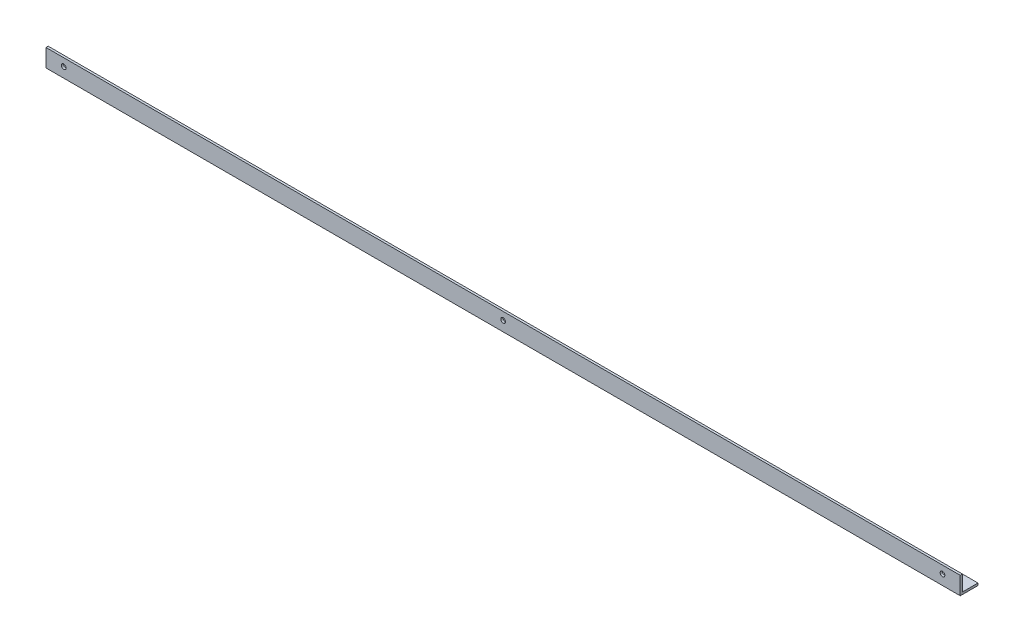
ISO-10303-21;
HEADER;
FILE_DESCRIPTION(('STEP AP214'),'2;1');
FILE_NAME('part.step','',(''),(''),'','','');
FILE_SCHEMA(('AUTOMOTIVE_DESIGN { 1 0 10303 214 1 1 1 1 }'));
ENDSEC;
DATA;
#1=APPLICATION_CONTEXT('core data for automotive mechanical design processes');
#2=APPLICATION_PROTOCOL_DEFINITION('international standard','automotive_design',2000,#1);
#3=PRODUCT_CONTEXT('',#1,'mechanical');
#4=PRODUCT('Part','Part','',(#3));
#5=PRODUCT_RELATED_PRODUCT_CATEGORY('part','',(#4));
#6=PRODUCT_DEFINITION_FORMATION('','',#4);
#7=PRODUCT_DEFINITION_CONTEXT('part definition',#1,'design');
#8=PRODUCT_DEFINITION('design','',#6,#7);
#9=PRODUCT_DEFINITION_SHAPE('','',#8);
#10=(LENGTH_UNIT() NAMED_UNIT(*) SI_UNIT(.MILLI.,.METRE.));
#11=(NAMED_UNIT(*) PLANE_ANGLE_UNIT() SI_UNIT($,.RADIAN.));
#12=(NAMED_UNIT(*) SI_UNIT($,.STERADIAN.) SOLID_ANGLE_UNIT());
#13=UNCERTAINTY_MEASURE_WITH_UNIT(LENGTH_MEASURE(1.E-05),#10,'distance_accuracy_value','');
#14=(GEOMETRIC_REPRESENTATION_CONTEXT(3) GLOBAL_UNCERTAINTY_ASSIGNED_CONTEXT((#13)) GLOBAL_UNIT_ASSIGNED_CONTEXT((#10,
#11,#12)) REPRESENTATION_CONTEXT('',''));
#15=CARTESIAN_POINT('',(0.,0.,0.));
#16=DIRECTION('',(0.,0.,1.));
#17=DIRECTION('',(1.,0.,0.));
#18=AXIS2_PLACEMENT_3D('',#15,#16,#17);
#19=CARTESIAN_POINT('',(-1307.86854000227,166.234228507342,2858.97175722218));
#20=DIRECTION('',(-1.,0.,0.));
#21=DIRECTION('',(0.,0.26471698178117,-0.964326147917118));
#22=AXIS2_PLACEMENT_3D('',#19,#20,#21);
#23=PLANE('',#22);
#24=DIRECTION('',(0.,-1.,0.));
#25=VECTOR('',#24,1.);
#26=CARTESIAN_POINT('',(-1307.86854000227,1.58750000000062,2820.87175722218));
#27=LINE('',#26,#25);
#28=CARTESIAN_POINT('',(-1307.86854000227,3.17500000000019,2820.87175722218));
#29=VERTEX_POINT('',#28);
#30=CARTESIAN_POINT('',(-1307.86854000227,0.,2820.87175722218));
#31=VERTEX_POINT('',#30);
#32=EDGE_CURVE('E200',#29,#31,#27,.T.);
#33=ORIENTED_EDGE('',*,*,#32,.T.);
#34=DIRECTION('',(0.,0.,1.));
#35=VECTOR('',#34,1.);
#36=CARTESIAN_POINT('',(-1307.86854000227,1.54219239510193E-13,2833.57175722218));
#37=LINE('',#36,#35);
#38=CARTESIAN_POINT('',(-1307.86854000227,-1.2884804952989E-12,2846.27175722218));
#39=VERTEX_POINT('',#38);
#40=EDGE_CURVE('E183',#31,#39,#37,.T.);
#41=ORIENTED_EDGE('',*,*,#40,.T.);
#42=DIRECTION('',(0.,1.,0.));
#43=VECTOR('',#42,1.);
#44=CARTESIAN_POINT('',(-1307.86854000227,12.6999999999988,2846.27175722218));
#45=LINE('',#44,#43);
#46=CARTESIAN_POINT('',(-1307.86854000227,25.4,2846.27175722218));
#47=VERTEX_POINT('',#46);
#48=EDGE_CURVE('E128',#39,#47,#45,.T.);
#49=ORIENTED_EDGE('',*,*,#48,.T.);
#50=DIRECTION('',(0.,0.,-1.));
#51=VECTOR('',#50,1.);
#52=CARTESIAN_POINT('',(-1307.86854000227,25.4000000000001,2844.68425722218));
#53=LINE('',#52,#51);
#54=CARTESIAN_POINT('',(-1307.86854000227,25.4000000000003,2843.09675722218));
#55=VERTEX_POINT('',#54);
#56=EDGE_CURVE('E113',#47,#55,#53,.T.);
#57=ORIENTED_EDGE('',*,*,#56,.T.);
#58=DIRECTION('',(0.,-1.,0.));
#59=VECTOR('',#58,1.);
#60=CARTESIAN_POINT('',(-1307.86854000227,14.2875000000003,2843.09675722218));
#61=LINE('',#60,#59);
#62=CARTESIAN_POINT('',(-1307.86854000227,3.17500000000025,2843.09675722218));
#63=VERTEX_POINT('',#62);
#64=EDGE_CURVE('E125',#55,#63,#61,.T.);
#65=ORIENTED_EDGE('',*,*,#64,.T.);
#66=DIRECTION('',(0.,0.,-1.));
#67=VECTOR('',#66,1.);
#68=CARTESIAN_POINT('',(-1307.86854000227,3.17500000000041,2831.98425722218));
#69=LINE('',#68,#67);
#70=EDGE_CURVE('E130',#63,#29,#69,.T.);
#71=ORIENTED_EDGE('',*,*,#70,.T.);
#72=EDGE_LOOP('',(#33,#41,#49,#57,#65,#71));
#73=FACE_BOUND('',#72,.T.);
#74=ADVANCED_FACE('F42',(#73),#23,.T.);
#75=CARTESIAN_POINT('',(-5072.16606568212,1.58750000000062,2820.87175722218));
#76=DIRECTION('',(0.,0.,1.));
#77=DIRECTION('',(0.,1.,0.));
#78=AXIS2_PLACEMENT_3D('',#75,#76,#77);
#79=PLANE('',#78);
#80=DIRECTION('',(1.,0.,0.));
#81=VECTOR('',#80,1.);
#82=CARTESIAN_POINT('',(-5072.16606568212,0.,2820.87175722218));
#83=LINE('',#82,#81);
#84=CARTESIAN_POINT('',(0.,0.,2820.87175722218));
#85=VERTEX_POINT('',#84);
#86=EDGE_CURVE('E146',#31,#85,#83,.T.);
#87=ORIENTED_EDGE('',*,*,#86,.F.);
#88=ORIENTED_EDGE('',*,*,#32,.F.);
#89=DIRECTION('',(1.,0.,0.));
#90=VECTOR('',#89,1.);
#91=CARTESIAN_POINT('',(-5072.16606568212,3.17500000000019,2820.87175722218));
#92=LINE('',#91,#90);
#93=CARTESIAN_POINT('',(0.,3.17500000000019,2820.87175722218));
#94=VERTEX_POINT('',#93);
#95=EDGE_CURVE('E143',#29,#94,#92,.T.);
#96=ORIENTED_EDGE('',*,*,#95,.T.);
#97=DIRECTION('',(0.,-1.,0.));
#98=VECTOR('',#97,1.);
#99=CARTESIAN_POINT('',(0.,1.58750000000062,2820.87175722218));
#100=LINE('',#99,#98);
#101=EDGE_CURVE('E182',#94,#85,#100,.T.);
#102=ORIENTED_EDGE('',*,*,#101,.T.);
#103=EDGE_LOOP('',(#87,#88,#96,#102));
#104=FACE_BOUND('',#103,.T.);
#105=ADVANCED_FACE('F211',(#104),#79,.F.);
#106=CARTESIAN_POINT('',(-5072.16606568212,1.54219239510193E-13,2833.57175722218));
#107=DIRECTION('',(0.,1.,0.));
#108=DIRECTION('',(0.,0.,-1.));
#109=AXIS2_PLACEMENT_3D('',#106,#107,#108);
#110=PLANE('',#109);
#111=DIRECTION('',(1.,0.,0.));
#112=VECTOR('',#111,1.);
#113=CARTESIAN_POINT('',(-5072.16606568212,-1.2884804952989E-12,2846.27175722218));
#114=LINE('',#113,#112);
#115=CARTESIAN_POINT('',(-1.77635683940025E-12,-1.2884804952989E-12,2846.27175722218));
#116=VERTEX_POINT('',#115);
#117=EDGE_CURVE('E150',#39,#116,#114,.T.);
#118=ORIENTED_EDGE('',*,*,#117,.F.);
#119=ORIENTED_EDGE('',*,*,#40,.F.);
#120=ORIENTED_EDGE('',*,*,#86,.T.);
#121=DIRECTION('',(0.,0.,1.));
#122=VECTOR('',#121,1.);
#123=CARTESIAN_POINT('',(0.,1.54219239510193E-13,2833.57175722218));
#124=LINE('',#123,#122);
#125=EDGE_CURVE('E187',#85,#116,#124,.T.);
#126=ORIENTED_EDGE('',*,*,#125,.T.);
#127=EDGE_LOOP('',(#118,#119,#120,#126));
#128=FACE_BOUND('',#127,.T.);
#129=ADVANCED_FACE('F215',(#128),#110,.F.);
#130=CARTESIAN_POINT('',(-5072.16606568212,12.6999999999988,2846.27175722218));
#131=DIRECTION('',(0.,0.,-1.));
#132=DIRECTION('',(0.,-1.,0.));
#133=AXIS2_PLACEMENT_3D('',#130,#131,#132);
#134=PLANE('',#133);
#135=CARTESIAN_POINT('',(-653.934270001134,14.2875000000003,2846.27175722218));
#136=DIRECTION('',(0.,0.,-1.));
#137=DIRECTION('',(0.,-1.,0.));
#138=AXIS2_PLACEMENT_3D('',#135,#136,#137);
#139=CIRCLE('',#138,3.37819999999983);
#140=CARTESIAN_POINT('',(-653.934270001134,10.9093000000005,2846.27175722218));
#141=VERTEX_POINT('',#140);
#142=EDGE_CURVE('E161',#141,#141,#139,.F.);
#143=ORIENTED_EDGE('',*,*,#142,.F.);
#144=EDGE_LOOP('',(#143));
#145=FACE_BOUND('',#144,.T.);
#146=CARTESIAN_POINT('',(-25.4000000000012,14.2875000000003,2846.27175722218));
#147=DIRECTION('',(0.,0.,-1.));
#148=DIRECTION('',(0.,-1.,0.));
#149=AXIS2_PLACEMENT_3D('',#146,#147,#148);
#150=CIRCLE('',#149,3.37819999999983);
#151=CARTESIAN_POINT('',(-25.4000000000012,10.9093000000005,2846.27175722218));
#152=VERTEX_POINT('',#151);
#153=EDGE_CURVE('E157',#152,#152,#150,.F.);
#154=ORIENTED_EDGE('',*,*,#153,.F.);
#155=EDGE_LOOP('',(#154));
#156=FACE_BOUND('',#155,.T.);
#157=CARTESIAN_POINT('',(-1282.46854000227,14.2874999999999,2846.27175722218));
#158=DIRECTION('',(0.,0.,-1.));
#159=DIRECTION('',(0.,-1.,0.));
#160=AXIS2_PLACEMENT_3D('',#157,#158,#159);
#161=CIRCLE('',#160,3.37820000000005);
#162=CARTESIAN_POINT('',(-1282.46854000227,10.9092999999999,2846.27175722218));
#163=VERTEX_POINT('',#162);
#164=EDGE_CURVE('E133',#163,#163,#161,.F.);
#165=ORIENTED_EDGE('',*,*,#164,.F.);
#166=EDGE_LOOP('',(#165));
#167=FACE_BOUND('',#166,.T.);
#168=DIRECTION('',(1.,0.,0.));
#169=VECTOR('',#168,1.);
#170=CARTESIAN_POINT('',(-5072.16606568212,25.4,2846.27175722218));
#171=LINE('',#170,#169);
#172=CARTESIAN_POINT('',(-1.77635683940025E-12,25.4,2846.27175722218));
#173=VERTEX_POINT('',#172);
#174=EDGE_CURVE('E118',#47,#173,#171,.T.);
#175=ORIENTED_EDGE('',*,*,#174,.F.);
#176=ORIENTED_EDGE('',*,*,#48,.F.);
#177=ORIENTED_EDGE('',*,*,#117,.T.);
#178=DIRECTION('',(0.,1.,0.));
#179=VECTOR('',#178,1.);
#180=CARTESIAN_POINT('',(-1.77635683940025E-12,12.6999999999988,2846.27175722218));
#181=LINE('',#180,#179);
#182=EDGE_CURVE('E191',#116,#173,#181,.T.);
#183=ORIENTED_EDGE('',*,*,#182,.T.);
#184=EDGE_LOOP('',(#175,#176,#177,#183));
#185=FACE_BOUND('',#184,.T.);
#186=ADVANCED_FACE('F217',(#145,#156,#167,#185),#134,.F.);
#187=CARTESIAN_POINT('',(-5072.16606568212,3.17500000000042,2831.98425722218));
#188=DIRECTION('',(0.,-1.,0.));
#189=DIRECTION('',(0.,0.,1.));
#190=AXIS2_PLACEMENT_3D('',#187,#188,#189);
#191=PLANE('',#190);
#192=ORIENTED_EDGE('',*,*,#95,.F.);
#193=ORIENTED_EDGE('',*,*,#70,.F.);
#194=DIRECTION('',(1.,0.,0.));
#195=VECTOR('',#194,1.);
#196=CARTESIAN_POINT('',(-5072.16606568212,3.17500000000025,2843.09675722218));
#197=LINE('',#196,#195);
#198=CARTESIAN_POINT('',(0.,3.17500000000025,2843.09675722218));
#199=VERTEX_POINT('',#198);
#200=EDGE_CURVE('E11',#63,#199,#197,.T.);
#201=ORIENTED_EDGE('',*,*,#200,.T.);
#202=DIRECTION('',(0.,0.,-1.));
#203=VECTOR('',#202,1.);
#204=CARTESIAN_POINT('',(-1.77635683940025E-12,3.17500000000042,2831.98425722218));
#205=LINE('',#204,#203);
#206=EDGE_CURVE('E179',#199,#94,#205,.T.);
#207=ORIENTED_EDGE('',*,*,#206,.T.);
#208=EDGE_LOOP('',(#192,#193,#201,#207));
#209=FACE_BOUND('',#208,.T.);
#210=ADVANCED_FACE('F208',(#209),#191,.F.);
#211=CARTESIAN_POINT('',(-5072.16606568213,25.4000000000001,2844.68425722218));
#212=DIRECTION('',(0.,-1.,0.));
#213=DIRECTION('',(0.,0.,1.));
#214=AXIS2_PLACEMENT_3D('',#211,#212,#213);
#215=PLANE('',#214);
#216=DIRECTION('',(1.,0.,0.));
#217=VECTOR('',#216,1.);
#218=CARTESIAN_POINT('',(-5072.16606568212,25.4000000000003,2843.09675722218));
#219=LINE('',#218,#217);
#220=CARTESIAN_POINT('',(0.,25.4000000000003,2843.09675722218));
#221=VERTEX_POINT('',#220);
#222=EDGE_CURVE('E52',#55,#221,#219,.T.);
#223=ORIENTED_EDGE('',*,*,#222,.F.);
#224=ORIENTED_EDGE('',*,*,#56,.F.);
#225=ORIENTED_EDGE('',*,*,#174,.T.);
#226=DIRECTION('',(0.,0.,-1.));
#227=VECTOR('',#226,1.);
#228=CARTESIAN_POINT('',(0.,25.4000000000001,2844.68425722218));
#229=LINE('',#228,#227);
#230=EDGE_CURVE('E115',#173,#221,#229,.T.);
#231=ORIENTED_EDGE('',*,*,#230,.T.);
#232=EDGE_LOOP('',(#223,#224,#225,#231));
#233=FACE_BOUND('',#232,.T.);
#234=ADVANCED_FACE('F112',(#233),#215,.F.);
#235=CARTESIAN_POINT('',(-5072.16606568212,14.2875000000003,2843.09675722218));
#236=DIRECTION('',(0.,0.,1.));
#237=DIRECTION('',(0.,1.,0.));
#238=AXIS2_PLACEMENT_3D('',#235,#236,#237);
#239=PLANE('',#238);
#240=CARTESIAN_POINT('',(-653.934270001134,14.2875000000008,2843.09675722218));
#241=DIRECTION('',(0.,0.,1.));
#242=DIRECTION('',(0.,1.,0.));
#243=AXIS2_PLACEMENT_3D('',#240,#241,#242);
#244=CIRCLE('',#243,3.37819999999983);
#245=CARTESIAN_POINT('',(-653.934270001134,17.6657000000006,2843.09675722218));
#246=VERTEX_POINT('',#245);
#247=EDGE_CURVE('E46',#246,#246,#244,.F.);
#248=ORIENTED_EDGE('',*,*,#247,.F.);
#249=EDGE_LOOP('',(#248));
#250=FACE_BOUND('',#249,.T.);
#251=CARTESIAN_POINT('',(-25.3999999999994,14.2875000000008,2843.09675722218));
#252=DIRECTION('',(0.,0.,1.));
#253=DIRECTION('',(0.,1.,0.));
#254=AXIS2_PLACEMENT_3D('',#251,#252,#253);
#255=CIRCLE('',#254,3.37819999999983);
#256=CARTESIAN_POINT('',(-25.3999999999994,17.6657000000006,2843.09675722218));
#257=VERTEX_POINT('',#256);
#258=EDGE_CURVE('E158',#257,#257,#255,.F.);
#259=ORIENTED_EDGE('',*,*,#258,.F.);
#260=EDGE_LOOP('',(#259));
#261=FACE_BOUND('',#260,.T.);
#262=CARTESIAN_POINT('',(-1282.46854000227,14.2875000000003,2843.09675722218));
#263=DIRECTION('',(0.,0.,1.));
#264=DIRECTION('',(0.,1.,0.));
#265=AXIS2_PLACEMENT_3D('',#262,#263,#264);
#266=CIRCLE('',#265,3.37820000000005);
#267=CARTESIAN_POINT('',(-1282.46854000227,17.6657000000004,2843.09675722218));
#268=VERTEX_POINT('',#267);
#269=EDGE_CURVE('E139',#268,#268,#266,.F.);
#270=ORIENTED_EDGE('',*,*,#269,.F.);
#271=EDGE_LOOP('',(#270));
#272=FACE_BOUND('',#271,.T.);
#273=ORIENTED_EDGE('',*,*,#200,.F.);
#274=ORIENTED_EDGE('',*,*,#64,.F.);
#275=ORIENTED_EDGE('',*,*,#222,.T.);
#276=DIRECTION('',(0.,-1.,0.));
#277=VECTOR('',#276,1.);
#278=CARTESIAN_POINT('',(0.,14.2875000000003,2843.09675722218));
#279=LINE('',#278,#277);
#280=EDGE_CURVE('E147',#221,#199,#279,.T.);
#281=ORIENTED_EDGE('',*,*,#280,.T.);
#282=EDGE_LOOP('',(#273,#274,#275,#281));
#283=FACE_BOUND('',#282,.T.);
#284=ADVANCED_FACE('F44',(#250,#261,#272,#283),#239,.F.);
#285=CARTESIAN_POINT('',(0.,166.234228507342,2858.97175722218));
#286=DIRECTION('',(-1.,0.,0.));
#287=DIRECTION('',(0.,0.26471698178117,-0.964326147917118));
#288=AXIS2_PLACEMENT_3D('',#285,#286,#287);
#289=PLANE('',#288);
#290=ORIENTED_EDGE('',*,*,#280,.F.);
#291=ORIENTED_EDGE('',*,*,#230,.F.);
#292=ORIENTED_EDGE('',*,*,#182,.F.);
#293=ORIENTED_EDGE('',*,*,#125,.F.);
#294=ORIENTED_EDGE('',*,*,#101,.F.);
#295=ORIENTED_EDGE('',*,*,#206,.F.);
#296=EDGE_LOOP('',(#290,#291,#292,#293,#294,#295));
#297=FACE_BOUND('',#296,.T.);
#298=ADVANCED_FACE('F220',(#297),#289,.F.);
#299=CARTESIAN_POINT('',(-1282.46854000227,14.2875000000028,-706.945233404852));
#300=DIRECTION('',(0.,0.,1.));
#301=DIRECTION('',(0.,1.,0.));
#302=AXIS2_PLACEMENT_3D('',#299,#300,#301);
#303=CYLINDRICAL_SURFACE('',#302,3.37820000000005);
#304=ORIENTED_EDGE('',*,*,#269,.T.);
#305=EDGE_LOOP('',(#304));
#306=FACE_BOUND('',#305,.T.);
#307=ORIENTED_EDGE('',*,*,#164,.T.);
#308=EDGE_LOOP('',(#307));
#309=FACE_BOUND('',#308,.T.);
#310=ADVANCED_FACE('F222',(#306,#309),#303,.F.);
#311=CARTESIAN_POINT('',(-25.3999999999994,14.2875000000028,-706.945233404852));
#312=DIRECTION('',(0.,0.,1.));
#313=DIRECTION('',(0.,1.,0.));
#314=AXIS2_PLACEMENT_3D('',#311,#312,#313);
#315=CYLINDRICAL_SURFACE('',#314,3.37819999999983);
#316=ORIENTED_EDGE('',*,*,#258,.T.);
#317=EDGE_LOOP('',(#316));
#318=FACE_BOUND('',#317,.T.);
#319=ORIENTED_EDGE('',*,*,#153,.T.);
#320=EDGE_LOOP('',(#319));
#321=FACE_BOUND('',#320,.T.);
#322=ADVANCED_FACE('F228',(#318,#321),#315,.F.);
#323=CARTESIAN_POINT('',(-653.934270001134,14.2875000000028,-706.945233404851));
#324=DIRECTION('',(0.,0.,1.));
#325=DIRECTION('',(0.,1.,0.));
#326=AXIS2_PLACEMENT_3D('',#323,#324,#325);
#327=CYLINDRICAL_SURFACE('',#326,3.37819999999983);
#328=ORIENTED_EDGE('',*,*,#247,.T.);
#329=EDGE_LOOP('',(#328));
#330=FACE_BOUND('',#329,.T.);
#331=ORIENTED_EDGE('',*,*,#142,.T.);
#332=EDGE_LOOP('',(#331));
#333=FACE_BOUND('',#332,.T.);
#334=ADVANCED_FACE('F286',(#330,#333),#327,.F.);
#335=CLOSED_SHELL('',(#74,#105,#129,#186,#210,#234,#284,#298,#310,#322,#334));
#336=MANIFOLD_SOLID_BREP('B2',#335);
#337=ADVANCED_BREP_SHAPE_REPRESENTATION('',(#18,#336),#14);
#338=SHAPE_DEFINITION_REPRESENTATION(#9,#337);
ENDSEC;
END-ISO-10303-21;
